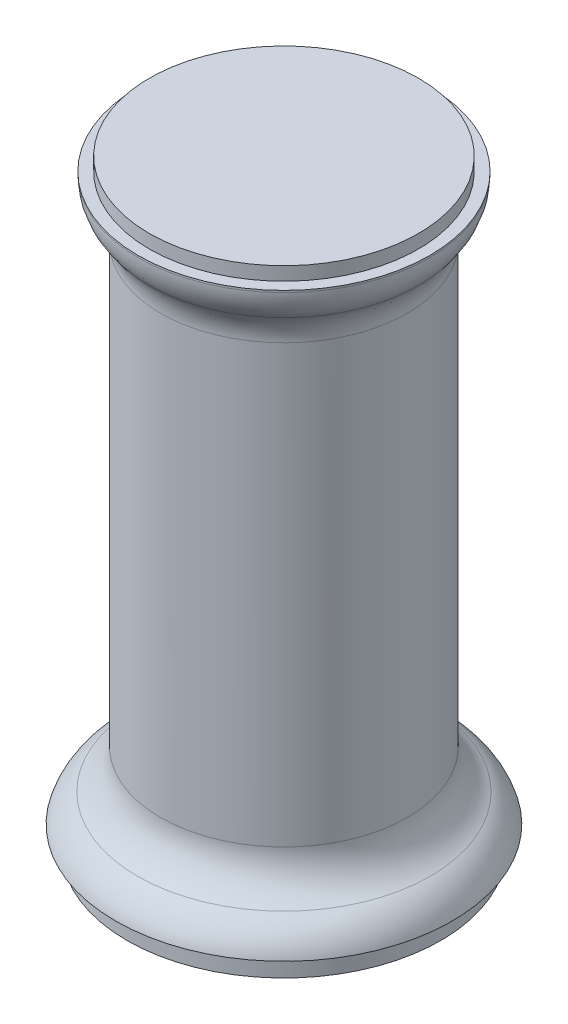
ISO-10303-21;
HEADER;
FILE_DESCRIPTION(('STEP AP214'),'2;1');
FILE_NAME('part.step','',(''),(''),'','','');
FILE_SCHEMA(('AUTOMOTIVE_DESIGN { 1 0 10303 214 1 1 1 1 }'));
ENDSEC;
DATA;
#1=APPLICATION_CONTEXT('core data for automotive mechanical design processes');
#2=APPLICATION_PROTOCOL_DEFINITION('international standard','automotive_design',2000,#1);
#3=PRODUCT_CONTEXT('',#1,'mechanical');
#4=PRODUCT('Part','Part','',(#3));
#5=PRODUCT_RELATED_PRODUCT_CATEGORY('part','',(#4));
#6=PRODUCT_DEFINITION_FORMATION('','',#4);
#7=PRODUCT_DEFINITION_CONTEXT('part definition',#1,'design');
#8=PRODUCT_DEFINITION('design','',#6,#7);
#9=PRODUCT_DEFINITION_SHAPE('','',#8);
#10=(LENGTH_UNIT() NAMED_UNIT(*) SI_UNIT(.MILLI.,.METRE.));
#11=(NAMED_UNIT(*) PLANE_ANGLE_UNIT() SI_UNIT($,.RADIAN.));
#12=(NAMED_UNIT(*) SI_UNIT($,.STERADIAN.) SOLID_ANGLE_UNIT());
#13=UNCERTAINTY_MEASURE_WITH_UNIT(LENGTH_MEASURE(1.E-05),#10,'distance_accuracy_value','');
#14=(GEOMETRIC_REPRESENTATION_CONTEXT(3) GLOBAL_UNCERTAINTY_ASSIGNED_CONTEXT((#13)) GLOBAL_UNIT_ASSIGNED_CONTEXT((#10,
#11,#12)) REPRESENTATION_CONTEXT('',''));
#15=CARTESIAN_POINT('',(0.,0.,0.));
#16=DIRECTION('',(0.,0.,1.));
#17=DIRECTION('',(1.,0.,0.));
#18=AXIS2_PLACEMENT_3D('',#15,#16,#17);
#19=CARTESIAN_POINT('',(0.,5.,0.));
#20=DIRECTION('',(0.,-1.,0.));
#21=DIRECTION('',(0.,0.,-1.));
#22=AXIS2_PLACEMENT_3D('',#19,#20,#21);
#23=CYLINDRICAL_SURFACE('',#22,35.);
#24=CARTESIAN_POINT('',(0.,5.,0.));
#25=DIRECTION('',(0.,1.,0.));
#26=DIRECTION('',(0.,0.,1.));
#27=AXIS2_PLACEMENT_3D('',#24,#25,#26);
#28=CIRCLE('',#27,35.);
#29=CARTESIAN_POINT('',(0.,5.,35.));
#30=VERTEX_POINT('',#29);
#31=EDGE_CURVE('E65',#30,#30,#28,.T.);
#32=ORIENTED_EDGE('',*,*,#31,.F.);
#33=EDGE_LOOP('',(#32));
#34=FACE_BOUND('',#33,.T.);
#35=CARTESIAN_POINT('',(0.,0.,0.));
#36=DIRECTION('',(0.,1.,0.));
#37=DIRECTION('',(0.,0.,1.));
#38=AXIS2_PLACEMENT_3D('',#35,#36,#37);
#39=CIRCLE('',#38,35.);
#40=CARTESIAN_POINT('',(0.,0.,35.));
#41=VERTEX_POINT('',#40);
#42=EDGE_CURVE('E66',#41,#41,#39,.T.);
#43=ORIENTED_EDGE('',*,*,#42,.T.);
#44=EDGE_LOOP('',(#43));
#45=FACE_BOUND('',#44,.T.);
#46=ADVANCED_FACE('F42',(#34,#45),#23,.T.);
#47=CARTESIAN_POINT('',(0.,0.,0.));
#48=DIRECTION('',(0.,1.,0.));
#49=DIRECTION('',(0.,0.,1.));
#50=AXIS2_PLACEMENT_3D('',#47,#48,#49);
#51=PLANE('',#50);
#52=ORIENTED_EDGE('',*,*,#42,.F.);
#53=EDGE_LOOP('',(#52));
#54=FACE_BOUND('',#53,.T.);
#55=ADVANCED_FACE('F109',(#54),#51,.F.);
#56=CARTESIAN_POINT('',(0.,5.,0.));
#57=DIRECTION('',(0.,1.,0.));
#58=DIRECTION('',(0.,0.,1.));
#59=AXIS2_PLACEMENT_3D('',#56,#57,#58);
#60=PLANE('',#59);
#61=ORIENTED_EDGE('',*,*,#31,.T.);
#62=EDGE_LOOP('',(#61));
#63=FACE_BOUND('',#62,.T.);
#64=CARTESIAN_POINT('',(0.,5.,0.));
#65=DIRECTION('',(0.,1.,0.));
#66=DIRECTION('',(0.,0.,1.));
#67=AXIS2_PLACEMENT_3D('',#64,#65,#66);
#68=CIRCLE('',#67,37.5);
#69=CARTESIAN_POINT('',(0.,5.,37.5));
#70=VERTEX_POINT('',#69);
#71=EDGE_CURVE('E69',#70,#70,#68,.T.);
#72=ORIENTED_EDGE('',*,*,#71,.F.);
#73=EDGE_LOOP('',(#72));
#74=FACE_BOUND('',#73,.T.);
#75=ADVANCED_FACE('F105',(#63,#74),#60,.F.);
#76=CARTESIAN_POINT('',(0.,126.,0.));
#77=DIRECTION('',(0.,-1.,0.));
#78=DIRECTION('',(0.,0.,-1.));
#79=AXIS2_PLACEMENT_3D('',#76,#77,#78);
#80=CYLINDRICAL_SURFACE('',#79,27.5);
#81=CARTESIAN_POINT('',(0.,117.339745962156,0.));
#82=DIRECTION('',(0.,1.,0.));
#83=DIRECTION('',(0.,0.,1.));
#84=AXIS2_PLACEMENT_3D('',#81,#82,#83);
#85=CIRCLE('',#84,27.5);
#86=CARTESIAN_POINT('',(0.,117.339745962156,-27.5));
#87=VERTEX_POINT('',#86);
#88=EDGE_CURVE('E57',#87,#87,#85,.F.);
#89=CARTESIAN_POINT('',(0.,20.,0.));
#90=DIRECTION('',(0.,1.,0.));
#91=DIRECTION('',(0.,0.,1.));
#92=AXIS2_PLACEMENT_3D('',#89,#90,#91);
#93=CIRCLE('',#92,27.5);
#94=CARTESIAN_POINT('',(0.,20.,-27.5));
#95=VERTEX_POINT('',#94);
#96=EDGE_CURVE('E62',#95,#95,#93,.T.);
#97=CARTESIAN_POINT('',(0.,117.339745962156,-27.5));
#98=CARTESIAN_POINT('',(0.,116.32579027505,-27.5));
#99=CARTESIAN_POINT('',(0.,115.311834587944,-27.5));
#100=CARTESIAN_POINT('',(0.,113.283923213732,-27.5));
#101=CARTESIAN_POINT('',(0.,112.269967526627,-27.5));
#102=CARTESIAN_POINT('',(0.,110.242056152415,-27.5));
#103=CARTESIAN_POINT('',(0.,109.228100465309,-27.5));
#104=CARTESIAN_POINT('',(0.,107.200189091098,-27.5));
#105=CARTESIAN_POINT('',(0.,106.186233403992,-27.5));
#106=CARTESIAN_POINT('',(0.,104.15832202978,-27.5));
#107=CARTESIAN_POINT('',(0.,103.144366342675,-27.5));
#108=CARTESIAN_POINT('',(0.,101.116454968463,-27.5));
#109=CARTESIAN_POINT('',(0.,100.102499281357,-27.5));
#110=CARTESIAN_POINT('',(0.,98.0745879071456,-27.5));
#111=CARTESIAN_POINT('',(0.,97.0606322200398,-27.5));
#112=CARTESIAN_POINT('',(0.,95.0327208458283,-27.5));
#113=CARTESIAN_POINT('',(0.,94.0187651587225,-27.5));
#114=CARTESIAN_POINT('',(0.,91.9908537845109,-27.5));
#115=CARTESIAN_POINT('',(0.,90.9768980974051,-27.5));
#116=CARTESIAN_POINT('',(0.,88.9489867231936,-27.5));
#117=CARTESIAN_POINT('',(0.,87.9350310360878,-27.5));
#118=CARTESIAN_POINT('',(0.,85.9071196618762,-27.5));
#119=CARTESIAN_POINT('',(0.,84.8931639747704,-27.5));
#120=CARTESIAN_POINT('',(0.,82.8652526005588,-27.5));
#121=CARTESIAN_POINT('',(0.,81.851296913453,-27.5));
#122=CARTESIAN_POINT('',(0.,79.8233855392415,-27.5));
#123=CARTESIAN_POINT('',(0.,78.8094298521357,-27.5));
#124=CARTESIAN_POINT('',(0.,76.7815184779241,-27.5));
#125=CARTESIAN_POINT('',(0.,75.7675627908183,-27.5));
#126=CARTESIAN_POINT('',(0.,73.7396514166067,-27.5));
#127=CARTESIAN_POINT('',(0.,72.725695729501,-27.5));
#128=CARTESIAN_POINT('',(0.,70.6977843552894,-27.5));
#129=CARTESIAN_POINT('',(0.,69.6838286681836,-27.5));
#130=CARTESIAN_POINT('',(0.,67.655917293972,-27.5));
#131=CARTESIAN_POINT('',(0.,66.6419616068662,-27.5));
#132=CARTESIAN_POINT('',(0.,64.6140502326547,-27.5));
#133=CARTESIAN_POINT('',(0.,63.6000945455489,-27.5));
#134=CARTESIAN_POINT('',(0.,61.5721831713373,-27.5));
#135=CARTESIAN_POINT('',(0.,60.5582274842315,-27.5));
#136=CARTESIAN_POINT('',(0.,58.5303161100199,-27.5));
#137=CARTESIAN_POINT('',(0.,57.5163604229142,-27.5));
#138=CARTESIAN_POINT('',(0.,55.4884490487026,-27.5));
#139=CARTESIAN_POINT('',(0.,54.4744933615968,-27.5));
#140=CARTESIAN_POINT('',(0.,52.4465819873852,-27.5));
#141=CARTESIAN_POINT('',(0.,51.4326263002794,-27.5));
#142=CARTESIAN_POINT('',(0.,49.4047149260678,-27.5));
#143=CARTESIAN_POINT('',(0.,48.3907592389621,-27.5));
#144=CARTESIAN_POINT('',(0.,46.3628478647505,-27.5));
#145=CARTESIAN_POINT('',(0.,45.3488921776447,-27.5));
#146=CARTESIAN_POINT('',(0.,43.3209808034331,-27.5));
#147=CARTESIAN_POINT('',(0.,42.3070251163273,-27.5));
#148=CARTESIAN_POINT('',(0.,40.2791137421158,-27.5));
#149=CARTESIAN_POINT('',(0.,39.26515805501,-27.5));
#150=CARTESIAN_POINT('',(0.,37.2372466807984,-27.5));
#151=CARTESIAN_POINT('',(0.,36.2232909936926,-27.5));
#152=CARTESIAN_POINT('',(0.,34.195379619481,-27.5));
#153=CARTESIAN_POINT('',(0.,33.1814239323753,-27.5));
#154=CARTESIAN_POINT('',(0.,31.1535125581637,-27.5));
#155=CARTESIAN_POINT('',(0.,30.1395568710579,-27.5));
#156=CARTESIAN_POINT('',(0.,28.1116454968463,-27.5));
#157=CARTESIAN_POINT('',(0.,27.0976898097405,-27.5));
#158=CARTESIAN_POINT('',(0.,25.069778435529,-27.5));
#159=CARTESIAN_POINT('',(0.,24.0558227484232,-27.5));
#160=CARTESIAN_POINT('',(0.,22.0279113742116,-27.5));
#161=CARTESIAN_POINT('',(0.,21.0139556871058,-27.5));
#162=CARTESIAN_POINT('',(0.,20.,-27.5));
#163=B_SPLINE_CURVE_WITH_KNOTS('',3,(#97,#98,#99,#100,#101,#102,#103,#104,#105,#106,#107,#108,
#109,#110,#111,#112,#113,#114,#115,#116,#117,#118,#119,#120,#121,#122,#123,#124,#125,#126,#127,
#128,#129,#130,#131,#132,#133,#134,#135,#136,#137,#138,#139,#140,#141,#142,#143,#144,#145,#146,
#147,#148,#149,#150,#151,#152,#153,#154,#155,#156,#157,#158,#159,#160,#161,#162),.UNSPECIFIED.,
.F.,.F.,(4,2,2,2,2,2,2,2,2,2,2,2,2,2,2,2,2,2,2,2,2,2,2,2,2,2,2,2,2,2,2,2,4),(0.,
3.04186706131737,6.08373412263473,9.12560118395209,12.1674682452695,15.2093353065868,
18.2512023679042,21.2930694292215,24.3349364905389,27.3768035518563,30.4186706131736,
33.460537674491,36.5024047358084,39.5442717971257,42.5861388584431,45.6280059197604,
48.6698729810778,51.7117400423952,54.7536071037125,57.7954741650299,60.8373412263472,
63.8792082876646,66.921075348982,69.9629424102993,73.0048094716167,76.0466765329341,
79.0885435942514,82.1304106555688,85.1722777168862,88.2141447782035,91.2560118395209,
94.2978789008382,97.3397459621556),.UNSPECIFIED.);
#164=EDGE_CURVE('BSEAM100',#87,#95,#163,.T.);
#165=ORIENTED_EDGE('',*,*,#88,.T.);
#166=ORIENTED_EDGE('',*,*,#96,.T.);
#167=ORIENTED_EDGE('',*,*,#164,.T.);
#168=ORIENTED_EDGE('',*,*,#164,.F.);
#169=EDGE_LOOP('',(#165,#167,#166,#168));
#170=FACE_BOUND('',#169,.T.);
#171=ADVANCED_FACE('F100',(#170),#80,.T.);
#172=CARTESIAN_POINT('',(0.,131.,0.));
#173=DIRECTION('',(0.,-1.,0.));
#174=DIRECTION('',(0.,0.,-1.));
#175=AXIS2_PLACEMENT_3D('',#172,#173,#174);
#176=CYLINDRICAL_SURFACE('',#175,32.5);
#177=CARTESIAN_POINT('',(0.,130.568502517479,0.));
#178=DIRECTION('',(0.,-1.,0.));
#179=DIRECTION('',(0.,0.,-1.));
#180=AXIS2_PLACEMENT_3D('',#177,#178,#179);
#181=CIRCLE('',#180,32.5);
#182=CARTESIAN_POINT('',(0.,130.568502517479,-32.5));
#183=VERTEX_POINT('',#182);
#184=EDGE_CURVE('E49',#183,#183,#181,.F.);
#185=ORIENTED_EDGE('',*,*,#184,.T.);
#186=EDGE_LOOP('',(#185));
#187=FACE_BOUND('',#186,.T.);
#188=CARTESIAN_POINT('',(0.,131.,0.));
#189=DIRECTION('',(0.,1.,0.));
#190=DIRECTION('',(0.,0.,1.));
#191=AXIS2_PLACEMENT_3D('',#188,#189,#190);
#192=CIRCLE('',#191,32.5);
#193=CARTESIAN_POINT('',(0.,131.,32.5));
#194=VERTEX_POINT('',#193);
#195=EDGE_CURVE('E74',#194,#194,#192,.T.);
#196=ORIENTED_EDGE('',*,*,#195,.F.);
#197=EDGE_LOOP('',(#196));
#198=FACE_BOUND('',#197,.T.);
#199=ADVANCED_FACE('F95',(#187,#198),#176,.T.);
#200=CARTESIAN_POINT('',(0.,131.,0.));
#201=DIRECTION('',(0.,1.,0.));
#202=DIRECTION('',(0.,0.,1.));
#203=AXIS2_PLACEMENT_3D('',#200,#201,#202);
#204=PLANE('',#203);
#205=CARTESIAN_POINT('',(0.,131.,0.));
#206=DIRECTION('',(0.,1.,0.));
#207=DIRECTION('',(0.,0.,1.));
#208=AXIS2_PLACEMENT_3D('',#205,#206,#207);
#209=CIRCLE('',#208,30.);
#210=CARTESIAN_POINT('',(0.,131.,30.));
#211=VERTEX_POINT('',#210);
#212=EDGE_CURVE('E78',#211,#211,#209,.T.);
#213=ORIENTED_EDGE('',*,*,#212,.F.);
#214=EDGE_LOOP('',(#213));
#215=FACE_BOUND('',#214,.T.);
#216=ORIENTED_EDGE('',*,*,#195,.T.);
#217=EDGE_LOOP('',(#216));
#218=FACE_BOUND('',#217,.T.);
#219=ADVANCED_FACE('F89',(#215,#218),#204,.T.);
#220=CARTESIAN_POINT('',(0.,134.,0.));
#221=DIRECTION('',(0.,-1.,0.));
#222=DIRECTION('',(0.,0.,-1.));
#223=AXIS2_PLACEMENT_3D('',#220,#221,#222);
#224=CYLINDRICAL_SURFACE('',#223,30.);
#225=CARTESIAN_POINT('',(0.,134.,0.));
#226=DIRECTION('',(0.,1.,0.));
#227=DIRECTION('',(0.,0.,1.));
#228=AXIS2_PLACEMENT_3D('',#225,#226,#227);
#229=CIRCLE('',#228,30.);
#230=CARTESIAN_POINT('',(0.,134.,30.));
#231=VERTEX_POINT('',#230);
#232=EDGE_CURVE('E77',#231,#231,#229,.T.);
#233=ORIENTED_EDGE('',*,*,#232,.F.);
#234=EDGE_LOOP('',(#233));
#235=FACE_BOUND('',#234,.T.);
#236=ORIENTED_EDGE('',*,*,#212,.T.);
#237=EDGE_LOOP('',(#236));
#238=FACE_BOUND('',#237,.T.);
#239=ADVANCED_FACE('F86',(#235,#238),#224,.T.);
#240=CARTESIAN_POINT('',(0.,134.,0.));
#241=DIRECTION('',(0.,1.,0.));
#242=DIRECTION('',(0.,0.,1.));
#243=AXIS2_PLACEMENT_3D('',#240,#241,#242);
#244=PLANE('',#243);
#245=ORIENTED_EDGE('',*,*,#232,.T.);
#246=EDGE_LOOP('',(#245));
#247=FACE_BOUND('',#246,.T.);
#248=ADVANCED_FACE('F84',(#247),#244,.T.);
#249=CARTESIAN_POINT('',(0.,117.339745962156,0.));
#250=DIRECTION('',(0.,1.,0.));
#251=DIRECTION('',(0.,0.,1.));
#252=AXIS2_PLACEMENT_3D('',#249,#250,#251);
#253=TOROIDAL_SURFACE('',#252,37.5,10.);
#254=CARTESIAN_POINT('',(0.,123.954124239817,0.));
#255=DIRECTION('',(0.,-1.,0.));
#256=DIRECTION('',(0.,0.,-1.));
#257=AXIS2_PLACEMENT_3D('',#254,#255,#256);
#258=CIRCLE('',#257,30.);
#259=CARTESIAN_POINT('',(0.,123.954124239817,-30.));
#260=VERTEX_POINT('',#259);
#261=EDGE_CURVE('E12',#260,#260,#258,.T.);
#262=ORIENTED_EDGE('',*,*,#261,.T.);
#263=EDGE_LOOP('',(#262));
#264=FACE_BOUND('',#263,.T.);
#265=ORIENTED_EDGE('',*,*,#88,.F.);
#266=EDGE_LOOP('',(#265));
#267=FACE_BOUND('',#266,.T.);
#268=ADVANCED_FACE('F121',(#264,#267),#253,.F.);
#269=CARTESIAN_POINT('',(0.,20.,0.));
#270=DIRECTION('',(0.,1.,0.));
#271=DIRECTION('',(0.,0.,1.));
#272=AXIS2_PLACEMENT_3D('',#269,#270,#271);
#273=TOROIDAL_SURFACE('',#272,37.5,10.);
#274=CARTESIAN_POINT('',(0.,11.2499999999999,0.));
#275=DIRECTION('',(0.,1.,0.));
#276=DIRECTION('',(0.,0.,1.));
#277=AXIS2_PLACEMENT_3D('',#274,#275,#276);
#278=CIRCLE('',#277,32.6587708172407);
#279=CARTESIAN_POINT('',(0.,11.2499999999999,32.6587708172407));
#280=VERTEX_POINT('',#279);
#281=EDGE_CURVE('E53',#280,#280,#278,.T.);
#282=ORIENTED_EDGE('',*,*,#281,.T.);
#283=EDGE_LOOP('',(#282));
#284=FACE_BOUND('',#283,.T.);
#285=ORIENTED_EDGE('',*,*,#96,.F.);
#286=EDGE_LOOP('',(#285));
#287=FACE_BOUND('',#286,.T.);
#288=ADVANCED_FACE('F124',(#284,#287),#273,.F.);
#289=CARTESIAN_POINT('',(0.,2.5,0.));
#290=DIRECTION('',(0.,1.,0.));
#291=DIRECTION('',(0.,0.,1.));
#292=AXIS2_PLACEMENT_3D('',#289,#290,#291);
#293=TOROIDAL_SURFACE('',#292,27.8175416344815,10.);
#294=ORIENTED_EDGE('',*,*,#71,.T.);
#295=EDGE_LOOP('',(#294));
#296=FACE_BOUND('',#295,.T.);
#297=ORIENTED_EDGE('',*,*,#281,.F.);
#298=EDGE_LOOP('',(#297));
#299=FACE_BOUND('',#298,.T.);
#300=ADVANCED_FACE('F126',(#296,#299),#293,.T.);
#301=CARTESIAN_POINT('',(0.,130.568502517479,0.));
#302=DIRECTION('',(0.,-1.,0.));
#303=DIRECTION('',(0.,0.,-1.));
#304=AXIS2_PLACEMENT_3D('',#301,#302,#303);
#305=TOROIDAL_SURFACE('',#304,22.5,10.);
#306=ORIENTED_EDGE('',*,*,#261,.F.);
#307=EDGE_LOOP('',(#306));
#308=FACE_BOUND('',#307,.T.);
#309=ORIENTED_EDGE('',*,*,#184,.F.);
#310=EDGE_LOOP('',(#309));
#311=FACE_BOUND('',#310,.T.);
#312=ADVANCED_FACE('F44',(#308,#311),#305,.T.);
#313=CLOSED_SHELL('',(#46,#55,#75,#171,#199,#219,#239,#248,#268,#288,#300,#312));
#314=MANIFOLD_SOLID_BREP('B2',#313);
#315=ADVANCED_BREP_SHAPE_REPRESENTATION('',(#18,#314),#14);
#316=SHAPE_DEFINITION_REPRESENTATION(#9,#315);
ENDSEC;
END-ISO-10303-21;
